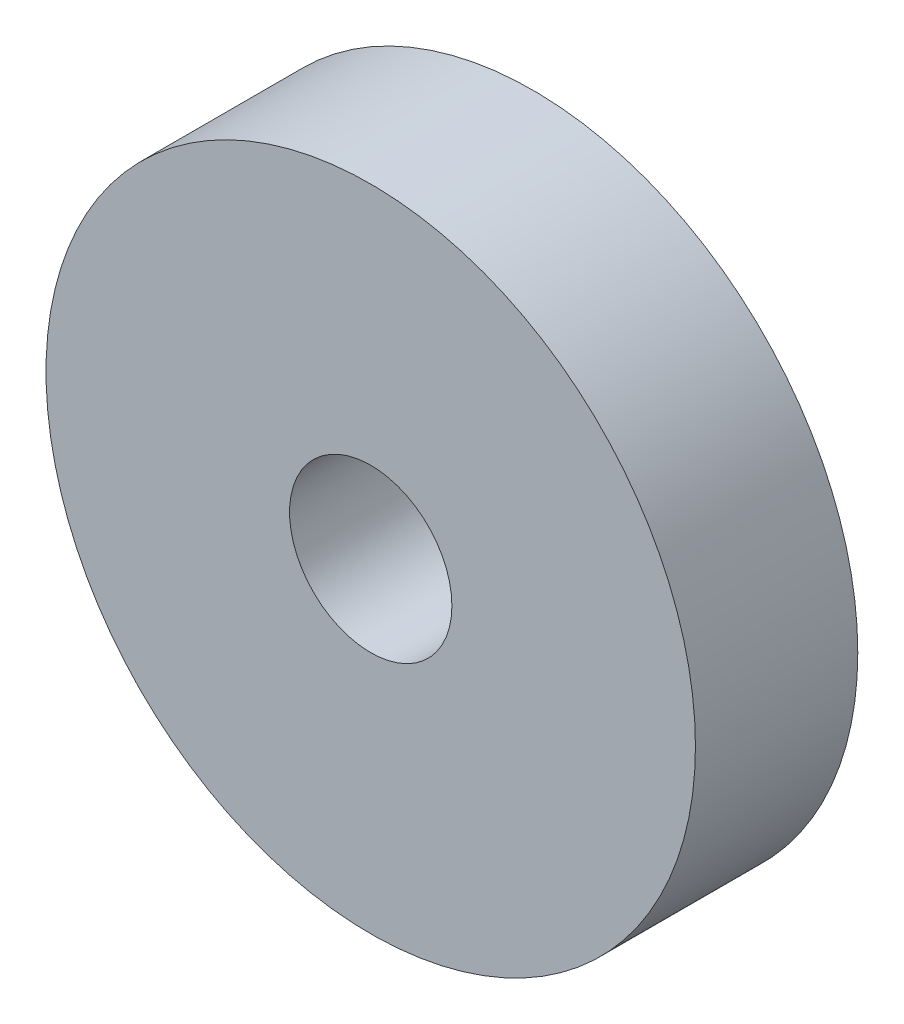
ISO-10303-21;
HEADER;
FILE_DESCRIPTION(('STEP AP214'),'2;1');
FILE_NAME('part.step','',(''),(''),'','','');
FILE_SCHEMA(('AUTOMOTIVE_DESIGN { 1 0 10303 214 1 1 1 1 }'));
ENDSEC;
DATA;
#1=APPLICATION_CONTEXT('core data for automotive mechanical design processes');
#2=APPLICATION_PROTOCOL_DEFINITION('international standard','automotive_design',2000,#1);
#3=PRODUCT_CONTEXT('',#1,'mechanical');
#4=PRODUCT('Part','Part','',(#3));
#5=PRODUCT_RELATED_PRODUCT_CATEGORY('part','',(#4));
#6=PRODUCT_DEFINITION_FORMATION('','',#4);
#7=PRODUCT_DEFINITION_CONTEXT('part definition',#1,'design');
#8=PRODUCT_DEFINITION('design','',#6,#7);
#9=PRODUCT_DEFINITION_SHAPE('','',#8);
#10=(LENGTH_UNIT() NAMED_UNIT(*) SI_UNIT(.MILLI.,.METRE.));
#11=(NAMED_UNIT(*) PLANE_ANGLE_UNIT() SI_UNIT($,.RADIAN.));
#12=(NAMED_UNIT(*) SI_UNIT($,.STERADIAN.) SOLID_ANGLE_UNIT());
#13=UNCERTAINTY_MEASURE_WITH_UNIT(LENGTH_MEASURE(1.E-05),#10,'distance_accuracy_value','');
#14=(GEOMETRIC_REPRESENTATION_CONTEXT(3) GLOBAL_UNCERTAINTY_ASSIGNED_CONTEXT((#13)) GLOBAL_UNIT_ASSIGNED_CONTEXT((#10,
#11,#12)) REPRESENTATION_CONTEXT('',''));
#15=CARTESIAN_POINT('',(0.,0.,0.));
#16=DIRECTION('',(0.,0.,1.));
#17=DIRECTION('',(1.,0.,0.));
#18=AXIS2_PLACEMENT_3D('',#15,#16,#17);
#19=CARTESIAN_POINT('',(0.,0.,3.));
#20=DIRECTION('',(0.,0.,1.));
#21=DIRECTION('',(1.,0.,0.));
#22=AXIS2_PLACEMENT_3D('',#19,#20,#21);
#23=PLANE('',#22);
#24=CARTESIAN_POINT('',(0.,0.,3.));
#25=DIRECTION('',(0.,0.,1.));
#26=DIRECTION('',(1.,0.,0.));
#27=AXIS2_PLACEMENT_3D('',#24,#25,#26);
#28=CIRCLE('',#27,6.);
#29=CARTESIAN_POINT('',(6.,0.,3.));
#30=VERTEX_POINT('',#29);
#31=EDGE_CURVE('E10',#30,#30,#28,.T.);
#32=ORIENTED_EDGE('',*,*,#31,.T.);
#33=EDGE_LOOP('',(#32));
#34=FACE_BOUND('',#33,.T.);
#35=CARTESIAN_POINT('',(0.,0.,3.));
#36=DIRECTION('',(0.,0.,1.));
#37=DIRECTION('',(1.,0.,0.));
#38=AXIS2_PLACEMENT_3D('',#35,#36,#37);
#39=CIRCLE('',#38,1.5);
#40=CARTESIAN_POINT('',(1.5,0.,3.));
#41=VERTEX_POINT('',#40);
#42=EDGE_CURVE('E42',#41,#41,#39,.T.);
#43=ORIENTED_EDGE('',*,*,#42,.F.);
#44=EDGE_LOOP('',(#43));
#45=FACE_BOUND('',#44,.T.);
#46=ADVANCED_FACE('F31',(#34,#45),#23,.T.);
#47=CARTESIAN_POINT('',(0.,0.,0.));
#48=DIRECTION('',(0.,0.,1.));
#49=DIRECTION('',(1.,0.,0.));
#50=AXIS2_PLACEMENT_3D('',#47,#48,#49);
#51=PLANE('',#50);
#52=CARTESIAN_POINT('',(0.,0.,0.));
#53=DIRECTION('',(0.,0.,1.));
#54=DIRECTION('',(1.,0.,0.));
#55=AXIS2_PLACEMENT_3D('',#52,#53,#54);
#56=CIRCLE('',#55,6.);
#57=CARTESIAN_POINT('',(6.,0.,0.));
#58=VERTEX_POINT('',#57);
#59=EDGE_CURVE('E35',#58,#58,#56,.T.);
#60=ORIENTED_EDGE('',*,*,#59,.F.);
#61=EDGE_LOOP('',(#60));
#62=FACE_BOUND('',#61,.T.);
#63=CARTESIAN_POINT('',(0.,0.,0.));
#64=DIRECTION('',(0.,0.,1.));
#65=DIRECTION('',(1.,0.,0.));
#66=AXIS2_PLACEMENT_3D('',#63,#64,#65);
#67=CIRCLE('',#66,1.5);
#68=CARTESIAN_POINT('',(1.5,0.,0.));
#69=VERTEX_POINT('',#68);
#70=EDGE_CURVE('E44',#69,#69,#67,.T.);
#71=ORIENTED_EDGE('',*,*,#70,.T.);
#72=EDGE_LOOP('',(#71));
#73=FACE_BOUND('',#72,.T.);
#74=ADVANCED_FACE('F54',(#62,#73),#51,.F.);
#75=CARTESIAN_POINT('',(0.,0.,3.));
#76=DIRECTION('',(0.,0.,-1.));
#77=DIRECTION('',(-1.,0.,0.));
#78=AXIS2_PLACEMENT_3D('',#75,#76,#77);
#79=CYLINDRICAL_SURFACE('',#78,6.);
#80=ORIENTED_EDGE('',*,*,#31,.F.);
#81=EDGE_LOOP('',(#80));
#82=FACE_BOUND('',#81,.T.);
#83=ORIENTED_EDGE('',*,*,#59,.T.);
#84=EDGE_LOOP('',(#83));
#85=FACE_BOUND('',#84,.T.);
#86=ADVANCED_FACE('F33',(#82,#85),#79,.T.);
#87=CARTESIAN_POINT('',(0.,0.,3.));
#88=DIRECTION('',(0.,0.,-1.));
#89=DIRECTION('',(-1.,0.,0.));
#90=AXIS2_PLACEMENT_3D('',#87,#88,#89);
#91=CYLINDRICAL_SURFACE('',#90,1.5);
#92=ORIENTED_EDGE('',*,*,#42,.T.);
#93=EDGE_LOOP('',(#92));
#94=FACE_BOUND('',#93,.T.);
#95=ORIENTED_EDGE('',*,*,#70,.F.);
#96=EDGE_LOOP('',(#95));
#97=FACE_BOUND('',#96,.T.);
#98=ADVANCED_FACE('F50',(#94,#97),#91,.F.);
#99=CLOSED_SHELL('',(#46,#74,#86,#98));
#100=MANIFOLD_SOLID_BREP('B2',#99);
#101=ADVANCED_BREP_SHAPE_REPRESENTATION('',(#18,#100),#14);
#102=SHAPE_DEFINITION_REPRESENTATION(#9,#101);
ENDSEC;
END-ISO-10303-21;
